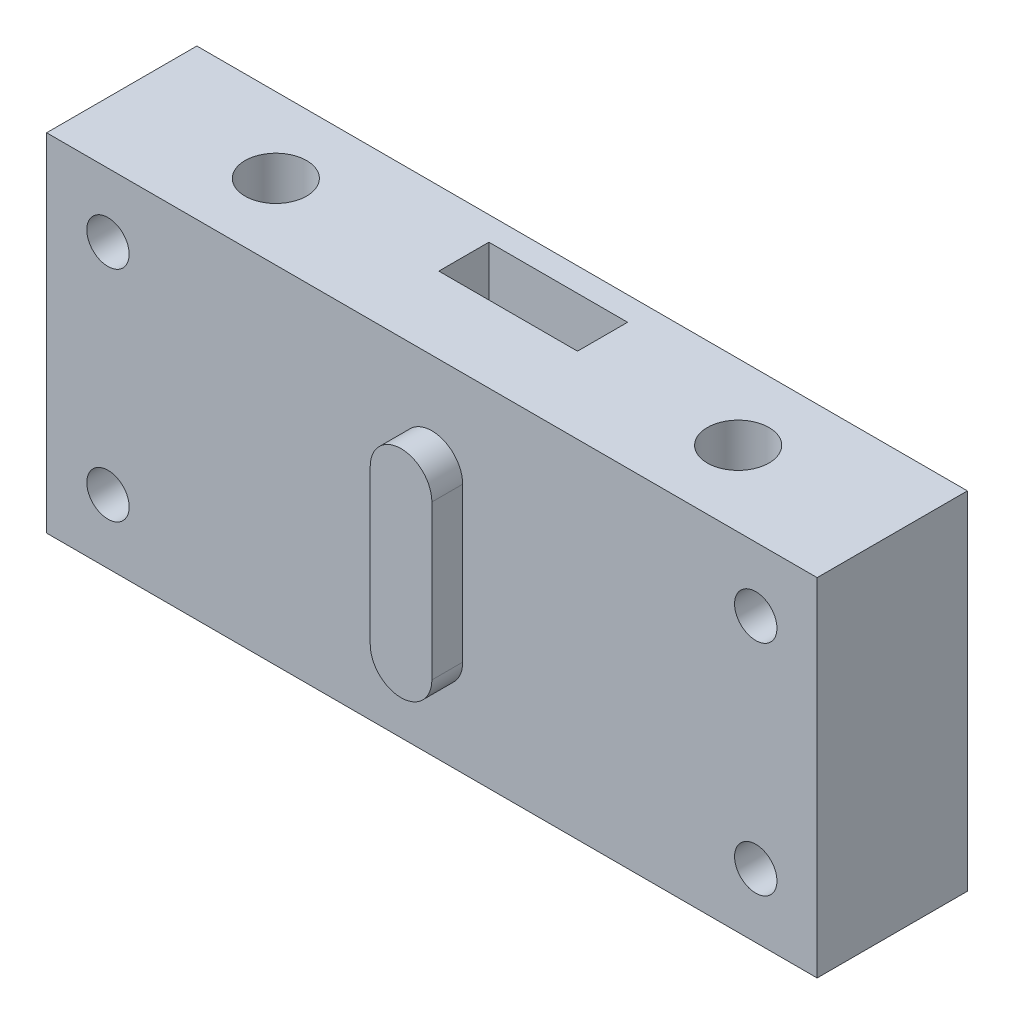
ISO-10303-21;
HEADER;
FILE_DESCRIPTION(('STEP AP214'),'2;1');
FILE_NAME('part.step','',(''),(''),'','','');
FILE_SCHEMA(('AUTOMOTIVE_DESIGN { 1 0 10303 214 1 1 1 1 }'));
ENDSEC;
DATA;
#1=APPLICATION_CONTEXT('core data for automotive mechanical design processes');
#2=APPLICATION_PROTOCOL_DEFINITION('international standard','automotive_design',2000,#1);
#3=PRODUCT_CONTEXT('',#1,'mechanical');
#4=PRODUCT('Part','Part','',(#3));
#5=PRODUCT_RELATED_PRODUCT_CATEGORY('part','',(#4));
#6=PRODUCT_DEFINITION_FORMATION('','',#4);
#7=PRODUCT_DEFINITION_CONTEXT('part definition',#1,'design');
#8=PRODUCT_DEFINITION('design','',#6,#7);
#9=PRODUCT_DEFINITION_SHAPE('','',#8);
#10=(LENGTH_UNIT() NAMED_UNIT(*) SI_UNIT(.MILLI.,.METRE.));
#11=(NAMED_UNIT(*) PLANE_ANGLE_UNIT() SI_UNIT($,.RADIAN.));
#12=(NAMED_UNIT(*) SI_UNIT($,.STERADIAN.) SOLID_ANGLE_UNIT());
#13=UNCERTAINTY_MEASURE_WITH_UNIT(LENGTH_MEASURE(1.E-05),#10,'distance_accuracy_value','');
#14=(GEOMETRIC_REPRESENTATION_CONTEXT(3) GLOBAL_UNCERTAINTY_ASSIGNED_CONTEXT((#13)) GLOBAL_UNIT_ASSIGNED_CONTEXT((#10,
#11,#12)) REPRESENTATION_CONTEXT('',''));
#15=CARTESIAN_POINT('',(0.,0.,0.));
#16=DIRECTION('',(0.,0.,1.));
#17=DIRECTION('',(1.,0.,0.));
#18=AXIS2_PLACEMENT_3D('',#15,#16,#17);
#19=CARTESIAN_POINT('',(0.,0.,19.5));
#20=DIRECTION('',(0.,0.,-1.));
#21=DIRECTION('',(-1.,0.,0.));
#22=AXIS2_PLACEMENT_3D('',#19,#20,#21);
#23=PLANE('',#22);
#24=DIRECTION('',(0.,-1.,0.));
#25=VECTOR('',#24,1.);
#26=CARTESIAN_POINT('',(-50.,22.5,19.5));
#27=LINE('',#26,#25);
#28=CARTESIAN_POINT('',(-50.,22.5,19.5));
#29=VERTEX_POINT('',#28);
#30=CARTESIAN_POINT('',(-50.,-22.5,19.5));
#31=VERTEX_POINT('',#30);
#32=EDGE_CURVE('E271',#29,#31,#27,.T.);
#33=ORIENTED_EDGE('',*,*,#32,.T.);
#34=DIRECTION('',(1.,0.,0.));
#35=VECTOR('',#34,1.);
#36=CARTESIAN_POINT('',(50.,-22.5,19.5));
#37=LINE('',#36,#35);
#38=CARTESIAN_POINT('',(50.,-22.5,19.5));
#39=VERTEX_POINT('',#38);
#40=EDGE_CURVE('E274',#31,#39,#37,.T.);
#41=ORIENTED_EDGE('',*,*,#40,.T.);
#42=DIRECTION('',(0.,1.,0.));
#43=VECTOR('',#42,1.);
#44=CARTESIAN_POINT('',(50.,22.5,19.5));
#45=LINE('',#44,#43);
#46=CARTESIAN_POINT('',(50.,22.5,19.5));
#47=VERTEX_POINT('',#46);
#48=EDGE_CURVE('E277',#39,#47,#45,.T.);
#49=ORIENTED_EDGE('',*,*,#48,.T.);
#50=DIRECTION('',(-1.,0.,0.));
#51=VECTOR('',#50,1.);
#52=CARTESIAN_POINT('',(50.,22.5,19.5));
#53=LINE('',#52,#51);
#54=EDGE_CURVE('E279',#47,#29,#53,.T.);
#55=ORIENTED_EDGE('',*,*,#54,.T.);
#56=EDGE_LOOP('',(#33,#41,#49,#55));
#57=FACE_BOUND('',#56,.T.);
#58=CARTESIAN_POINT('',(42.034787684969,14.200000000001,19.5));
#59=DIRECTION('',(0.,0.,-1.));
#60=DIRECTION('',(-1.,0.,0.));
#61=AXIS2_PLACEMENT_3D('',#58,#59,#60);
#62=CIRCLE('',#61,2.75);
#63=CARTESIAN_POINT('',(39.284787684969,14.200000000001,19.5));
#64=VERTEX_POINT('',#63);
#65=EDGE_CURVE('E253',#64,#64,#62,.T.);
#66=ORIENTED_EDGE('',*,*,#65,.T.);
#67=EDGE_LOOP('',(#66));
#68=FACE_BOUND('',#67,.T.);
#69=CARTESIAN_POINT('',(42.0347876849692,-14.2000000000005,19.5));
#70=DIRECTION('',(0.,0.,-1.));
#71=DIRECTION('',(-1.,0.,0.));
#72=AXIS2_PLACEMENT_3D('',#69,#70,#71);
#73=CIRCLE('',#72,2.7500000000004);
#74=CARTESIAN_POINT('',(39.2847876849688,-14.2000000000005,19.5));
#75=VERTEX_POINT('',#74);
#76=EDGE_CURVE('E235',#75,#75,#73,.T.);
#77=ORIENTED_EDGE('',*,*,#76,.T.);
#78=EDGE_LOOP('',(#77));
#79=FACE_BOUND('',#78,.T.);
#80=CARTESIAN_POINT('',(-42.0347876849692,-14.2000000000005,19.5));
#81=DIRECTION('',(0.,0.,-1.));
#82=DIRECTION('',(1.,0.,0.));
#83=AXIS2_PLACEMENT_3D('',#80,#81,#82);
#84=CIRCLE('',#83,2.75000000000038);
#85=CARTESIAN_POINT('',(-39.2847876849688,-14.2000000000005,19.5));
#86=VERTEX_POINT('',#85);
#87=EDGE_CURVE('E242',#86,#86,#84,.T.);
#88=ORIENTED_EDGE('',*,*,#87,.T.);
#89=EDGE_LOOP('',(#88));
#90=FACE_BOUND('',#89,.T.);
#91=CARTESIAN_POINT('',(-42.034787684969,14.200000000001,19.5));
#92=DIRECTION('',(0.,0.,-1.));
#93=DIRECTION('',(1.,0.,0.));
#94=AXIS2_PLACEMENT_3D('',#91,#92,#93);
#95=CIRCLE('',#94,2.75);
#96=CARTESIAN_POINT('',(-39.284787684969,14.200000000001,19.5));
#97=VERTEX_POINT('',#96);
#98=EDGE_CURVE('E248',#97,#97,#95,.T.);
#99=ORIENTED_EDGE('',*,*,#98,.T.);
#100=EDGE_LOOP('',(#99));
#101=FACE_BOUND('',#100,.T.);
#102=CARTESIAN_POINT('',(0.,10.,19.5));
#103=DIRECTION('',(0.,0.,1.));
#104=DIRECTION('',(1.,0.,0.));
#105=AXIS2_PLACEMENT_3D('',#102,#103,#104);
#106=CIRCLE('',#105,4.);
#107=CARTESIAN_POINT('',(4.,10.,19.5));
#108=VERTEX_POINT('',#107);
#109=CARTESIAN_POINT('',(-4.,10.,19.5));
#110=VERTEX_POINT('',#109);
#111=EDGE_CURVE('E166',#108,#110,#106,.T.);
#112=ORIENTED_EDGE('',*,*,#111,.F.);
#113=DIRECTION('',(0.,1.,0.));
#114=VECTOR('',#113,1.);
#115=CARTESIAN_POINT('',(4.,10.,19.5));
#116=LINE('',#115,#114);
#117=CARTESIAN_POINT('',(4.,-10.,19.5));
#118=VERTEX_POINT('',#117);
#119=EDGE_CURVE('E163',#118,#108,#116,.T.);
#120=ORIENTED_EDGE('',*,*,#119,.F.);
#121=CARTESIAN_POINT('',(0.,-10.,19.5));
#122=DIRECTION('',(0.,0.,1.));
#123=DIRECTION('',(1.,0.,0.));
#124=AXIS2_PLACEMENT_3D('',#121,#122,#123);
#125=CIRCLE('',#124,4.);
#126=CARTESIAN_POINT('',(-4.,-10.,19.5));
#127=VERTEX_POINT('',#126);
#128=EDGE_CURVE('E53',#127,#118,#125,.T.);
#129=ORIENTED_EDGE('',*,*,#128,.F.);
#130=DIRECTION('',(0.,-1.,0.));
#131=VECTOR('',#130,1.);
#132=CARTESIAN_POINT('',(-4.,10.,19.5));
#133=LINE('',#132,#131);
#134=EDGE_CURVE('E48',#110,#127,#133,.T.);
#135=ORIENTED_EDGE('',*,*,#134,.F.);
#136=EDGE_LOOP('',(#112,#120,#129,#135));
#137=FACE_BOUND('',#136,.T.);
#138=ADVANCED_FACE('F33',(#57,#68,#79,#90,#101,#137),#23,.F.);
#139=CARTESIAN_POINT('',(-8.99999999999998,-22.5,3.10000000000001));
#140=DIRECTION('',(0.,0.,-1.));
#141=DIRECTION('',(-1.,0.,0.));
#142=AXIS2_PLACEMENT_3D('',#139,#140,#141);
#143=PLANE('',#142);
#144=DIRECTION('',(0.,1.,0.));
#145=VECTOR('',#144,1.);
#146=CARTESIAN_POINT('',(8.99999999999999,-22.5,3.1));
#147=LINE('',#146,#145);
#148=CARTESIAN_POINT('',(8.99999999999999,-22.5,3.1));
#149=VERTEX_POINT('',#148);
#150=CARTESIAN_POINT('',(8.99999999999998,-5.,3.1));
#151=VERTEX_POINT('',#150);
#152=EDGE_CURVE('E227',#149,#151,#147,.T.);
#153=ORIENTED_EDGE('',*,*,#152,.T.);
#154=DIRECTION('',(-1.,0.,0.));
#155=VECTOR('',#154,1.);
#156=CARTESIAN_POINT('',(-8.99999999999998,-5.,3.10000000000001));
#157=LINE('',#156,#155);
#158=CARTESIAN_POINT('',(-8.99999999999998,-5.,3.10000000000001));
#159=VERTEX_POINT('',#158);
#160=EDGE_CURVE('E195',#151,#159,#157,.T.);
#161=ORIENTED_EDGE('',*,*,#160,.T.);
#162=DIRECTION('',(0.,1.,0.));
#163=VECTOR('',#162,1.);
#164=CARTESIAN_POINT('',(-8.99999999999998,-22.5,3.10000000000001));
#165=LINE('',#164,#163);
#166=CARTESIAN_POINT('',(-8.99999999999998,-22.5,3.10000000000001));
#167=VERTEX_POINT('',#166);
#168=EDGE_CURVE('E222',#167,#159,#165,.T.);
#169=ORIENTED_EDGE('',*,*,#168,.F.);
#170=DIRECTION('',(-1.,0.,0.));
#171=VECTOR('',#170,1.);
#172=CARTESIAN_POINT('',(-8.99999999999998,-22.5,3.10000000000001));
#173=LINE('',#172,#171);
#174=EDGE_CURVE('E209',#149,#167,#173,.T.);
#175=ORIENTED_EDGE('',*,*,#174,.F.);
#176=EDGE_LOOP('',(#153,#161,#169,#175));
#177=FACE_BOUND('',#176,.T.);
#178=ADVANCED_FACE('F322',(#177),#143,.F.);
#179=CARTESIAN_POINT('',(-50.,22.5,19.5));
#180=DIRECTION('',(1.,0.,0.));
#181=DIRECTION('',(0.,1.,0.));
#182=AXIS2_PLACEMENT_3D('',#179,#180,#181);
#183=PLANE('',#182);
#184=DIRECTION('',(0.,-1.,0.));
#185=VECTOR('',#184,1.);
#186=CARTESIAN_POINT('',(-50.,22.5,0.));
#187=LINE('',#186,#185);
#188=CARTESIAN_POINT('',(-50.,22.5,0.));
#189=VERTEX_POINT('',#188);
#190=CARTESIAN_POINT('',(-50.,-22.5,0.));
#191=VERTEX_POINT('',#190);
#192=EDGE_CURVE('E262',#189,#191,#187,.T.);
#193=ORIENTED_EDGE('',*,*,#192,.T.);
#194=DIRECTION('',(0.,0.,-1.));
#195=VECTOR('',#194,1.);
#196=CARTESIAN_POINT('',(-50.,-22.5,19.5));
#197=LINE('',#196,#195);
#198=EDGE_CURVE('E11',#31,#191,#197,.T.);
#199=ORIENTED_EDGE('',*,*,#198,.F.);
#200=ORIENTED_EDGE('',*,*,#32,.F.);
#201=DIRECTION('',(0.,0.,-1.));
#202=VECTOR('',#201,1.);
#203=CARTESIAN_POINT('',(-50.,22.5,19.5));
#204=LINE('',#203,#202);
#205=EDGE_CURVE('E281',#29,#189,#204,.T.);
#206=ORIENTED_EDGE('',*,*,#205,.T.);
#207=EDGE_LOOP('',(#193,#199,#200,#206));
#208=FACE_BOUND('',#207,.T.);
#209=ADVANCED_FACE('F35',(#208),#183,.F.);
#210=CARTESIAN_POINT('',(50.,-22.5,19.5));
#211=DIRECTION('',(0.,1.,0.));
#212=DIRECTION('',(-1.,0.,0.));
#213=AXIS2_PLACEMENT_3D('',#210,#211,#212);
#214=PLANE('',#213);
#215=ORIENTED_EDGE('',*,*,#174,.T.);
#216=DIRECTION('',(0.,0.,1.));
#217=VECTOR('',#216,1.);
#218=CARTESIAN_POINT('',(-8.99999999999998,-22.5,9.60000000000001));
#219=LINE('',#218,#217);
#220=CARTESIAN_POINT('',(-8.99999999999998,-22.5,9.60000000000001));
#221=VERTEX_POINT('',#220);
#222=EDGE_CURVE('E199',#167,#221,#219,.T.);
#223=ORIENTED_EDGE('',*,*,#222,.T.);
#224=DIRECTION('',(1.,0.,0.));
#225=VECTOR('',#224,1.);
#226=CARTESIAN_POINT('',(-8.99999999999998,-22.5,9.60000000000001));
#227=LINE('',#226,#225);
#228=CARTESIAN_POINT('',(8.99999999999999,-22.5,9.60000000000001));
#229=VERTEX_POINT('',#228);
#230=EDGE_CURVE('E202',#221,#229,#227,.T.);
#231=ORIENTED_EDGE('',*,*,#230,.T.);
#232=DIRECTION('',(0.,0.,-1.));
#233=VECTOR('',#232,1.);
#234=CARTESIAN_POINT('',(8.99999999999999,-22.5,9.60000000000001));
#235=LINE('',#234,#233);
#236=EDGE_CURVE('E206',#229,#149,#235,.T.);
#237=ORIENTED_EDGE('',*,*,#236,.T.);
#238=EDGE_LOOP('',(#215,#223,#231,#237));
#239=FACE_BOUND('',#238,.T.);
#240=CARTESIAN_POINT('',(-30.,-22.5,9.75000000000001));
#241=DIRECTION('',(0.,1.,0.));
#242=DIRECTION('',(-1.,0.,0.));
#243=AXIS2_PLACEMENT_3D('',#240,#241,#242);
#244=CIRCLE('',#243,4.);
#245=CARTESIAN_POINT('',(-34.,-22.5,9.75000000000001));
#246=VERTEX_POINT('',#245);
#247=EDGE_CURVE('E259',#246,#246,#244,.T.);
#248=ORIENTED_EDGE('',*,*,#247,.T.);
#249=EDGE_LOOP('',(#248));
#250=FACE_BOUND('',#249,.T.);
#251=CARTESIAN_POINT('',(30.,-22.5,9.75));
#252=DIRECTION('',(0.,1.,0.));
#253=DIRECTION('',(-1.,0.,0.));
#254=AXIS2_PLACEMENT_3D('',#251,#252,#253);
#255=CIRCLE('',#254,4.00000000000001);
#256=CARTESIAN_POINT('',(26.,-22.5,9.75));
#257=VERTEX_POINT('',#256);
#258=EDGE_CURVE('E266',#257,#257,#255,.T.);
#259=ORIENTED_EDGE('',*,*,#258,.T.);
#260=EDGE_LOOP('',(#259));
#261=FACE_BOUND('',#260,.T.);
#262=DIRECTION('',(1.,0.,0.));
#263=VECTOR('',#262,1.);
#264=CARTESIAN_POINT('',(50.,-22.5,0.));
#265=LINE('',#264,#263);
#266=CARTESIAN_POINT('',(50.,-22.5,0.));
#267=VERTEX_POINT('',#266);
#268=EDGE_CURVE('E284',#191,#267,#265,.T.);
#269=ORIENTED_EDGE('',*,*,#268,.T.);
#270=DIRECTION('',(0.,0.,-1.));
#271=VECTOR('',#270,1.);
#272=CARTESIAN_POINT('',(50.,-22.5,19.5));
#273=LINE('',#272,#271);
#274=EDGE_CURVE('E41',#39,#267,#273,.T.);
#275=ORIENTED_EDGE('',*,*,#274,.F.);
#276=ORIENTED_EDGE('',*,*,#40,.F.);
#277=ORIENTED_EDGE('',*,*,#198,.T.);
#278=EDGE_LOOP('',(#269,#275,#276,#277));
#279=FACE_BOUND('',#278,.T.);
#280=ADVANCED_FACE('F314',(#239,#250,#261,#279),#214,.F.);
#281=CARTESIAN_POINT('',(50.,22.5,19.5));
#282=DIRECTION('',(-1.,0.,0.));
#283=DIRECTION('',(0.,0.,1.));
#284=AXIS2_PLACEMENT_3D('',#281,#282,#283);
#285=PLANE('',#284);
#286=DIRECTION('',(0.,1.,0.));
#287=VECTOR('',#286,1.);
#288=CARTESIAN_POINT('',(50.,22.5,0.));
#289=LINE('',#288,#287);
#290=CARTESIAN_POINT('',(50.,22.5,0.));
#291=VERTEX_POINT('',#290);
#292=EDGE_CURVE('E286',#267,#291,#289,.T.);
#293=ORIENTED_EDGE('',*,*,#292,.T.);
#294=DIRECTION('',(0.,0.,-1.));
#295=VECTOR('',#294,1.);
#296=CARTESIAN_POINT('',(50.,22.5,19.5));
#297=LINE('',#296,#295);
#298=EDGE_CURVE('E291',#47,#291,#297,.T.);
#299=ORIENTED_EDGE('',*,*,#298,.F.);
#300=ORIENTED_EDGE('',*,*,#48,.F.);
#301=ORIENTED_EDGE('',*,*,#274,.T.);
#302=EDGE_LOOP('',(#293,#299,#300,#301));
#303=FACE_BOUND('',#302,.T.);
#304=ADVANCED_FACE('F298',(#303),#285,.F.);
#305=CARTESIAN_POINT('',(50.,22.5,19.5));
#306=DIRECTION('',(0.,-1.,0.));
#307=DIRECTION('',(1.,0.,0.));
#308=AXIS2_PLACEMENT_3D('',#305,#306,#307);
#309=PLANE('',#308);
#310=DIRECTION('',(1.,0.,0.));
#311=VECTOR('',#310,1.);
#312=CARTESIAN_POINT('',(-8.99999999999999,22.5,9.60000000000001));
#313=LINE('',#312,#311);
#314=CARTESIAN_POINT('',(-8.99999999999999,22.5,9.60000000000001));
#315=VERTEX_POINT('',#314);
#316=CARTESIAN_POINT('',(8.99999999999999,22.5,9.60000000000001));
#317=VERTEX_POINT('',#316);
#318=EDGE_CURVE('E214',#315,#317,#313,.T.);
#319=ORIENTED_EDGE('',*,*,#318,.F.);
#320=DIRECTION('',(0.,0.,1.));
#321=VECTOR('',#320,1.);
#322=CARTESIAN_POINT('',(-8.99999999999999,22.5,9.60000000000001));
#323=LINE('',#322,#321);
#324=CARTESIAN_POINT('',(-8.99999999999999,22.5,3.10000000000001));
#325=VERTEX_POINT('',#324);
#326=EDGE_CURVE('E198',#325,#315,#323,.T.);
#327=ORIENTED_EDGE('',*,*,#326,.F.);
#328=DIRECTION('',(-1.,0.,0.));
#329=VECTOR('',#328,1.);
#330=CARTESIAN_POINT('',(-8.99999999999999,22.5,3.10000000000001));
#331=LINE('',#330,#329);
#332=CARTESIAN_POINT('',(8.99999999999998,22.5,3.1));
#333=VERTEX_POINT('',#332);
#334=EDGE_CURVE('E203',#333,#325,#331,.T.);
#335=ORIENTED_EDGE('',*,*,#334,.F.);
#336=DIRECTION('',(0.,0.,-1.));
#337=VECTOR('',#336,1.);
#338=CARTESIAN_POINT('',(8.99999999999999,22.5,9.60000000000001));
#339=LINE('',#338,#337);
#340=EDGE_CURVE('E217',#317,#333,#339,.T.);
#341=ORIENTED_EDGE('',*,*,#340,.F.);
#342=EDGE_LOOP('',(#319,#327,#335,#341));
#343=FACE_BOUND('',#342,.T.);
#344=CARTESIAN_POINT('',(-30.,22.5,9.75000000000001));
#345=DIRECTION('',(0.,1.,0.));
#346=DIRECTION('',(-1.,0.,0.));
#347=AXIS2_PLACEMENT_3D('',#344,#345,#346);
#348=CIRCLE('',#347,4.);
#349=CARTESIAN_POINT('',(-34.,22.5,9.75000000000001));
#350=VERTEX_POINT('',#349);
#351=EDGE_CURVE('E263',#350,#350,#348,.T.);
#352=ORIENTED_EDGE('',*,*,#351,.F.);
#353=EDGE_LOOP('',(#352));
#354=FACE_BOUND('',#353,.T.);
#355=CARTESIAN_POINT('',(30.,22.5,9.75));
#356=DIRECTION('',(0.,1.,0.));
#357=DIRECTION('',(-1.,0.,0.));
#358=AXIS2_PLACEMENT_3D('',#355,#356,#357);
#359=CIRCLE('',#358,4.00000000000001);
#360=CARTESIAN_POINT('',(26.,22.5,9.75));
#361=VERTEX_POINT('',#360);
#362=EDGE_CURVE('E256',#361,#361,#359,.T.);
#363=ORIENTED_EDGE('',*,*,#362,.F.);
#364=EDGE_LOOP('',(#363));
#365=FACE_BOUND('',#364,.T.);
#366=DIRECTION('',(-1.,0.,0.));
#367=VECTOR('',#366,1.);
#368=CARTESIAN_POINT('',(50.,22.5,0.));
#369=LINE('',#368,#367);
#370=EDGE_CURVE('E275',#291,#189,#369,.T.);
#371=ORIENTED_EDGE('',*,*,#370,.T.);
#372=ORIENTED_EDGE('',*,*,#205,.F.);
#373=ORIENTED_EDGE('',*,*,#54,.F.);
#374=ORIENTED_EDGE('',*,*,#298,.T.);
#375=EDGE_LOOP('',(#371,#372,#373,#374));
#376=FACE_BOUND('',#375,.T.);
#377=ADVANCED_FACE('F307',(#343,#354,#365,#376),#309,.F.);
#378=CARTESIAN_POINT('',(0.,0.,0.));
#379=DIRECTION('',(0.,0.,-1.));
#380=DIRECTION('',(-1.,0.,0.));
#381=AXIS2_PLACEMENT_3D('',#378,#379,#380);
#382=PLANE('',#381);
#383=DIRECTION('',(0.,1.,0.));
#384=VECTOR('',#383,1.);
#385=CARTESIAN_POINT('',(-8.99999999999998,5.,0.));
#386=LINE('',#385,#384);
#387=CARTESIAN_POINT('',(-8.99999999999998,-5.,0.));
#388=VERTEX_POINT('',#387);
#389=CARTESIAN_POINT('',(-8.99999999999998,5.,0.));
#390=VERTEX_POINT('',#389);
#391=EDGE_CURVE('E167',#388,#390,#386,.T.);
#392=ORIENTED_EDGE('',*,*,#391,.F.);
#393=DIRECTION('',(-1.,0.,0.));
#394=VECTOR('',#393,1.);
#395=CARTESIAN_POINT('',(8.99999999999998,-5.,0.));
#396=LINE('',#395,#394);
#397=CARTESIAN_POINT('',(8.99999999999998,-5.,0.));
#398=VERTEX_POINT('',#397);
#399=EDGE_CURVE('E180',#398,#388,#396,.T.);
#400=ORIENTED_EDGE('',*,*,#399,.F.);
#401=DIRECTION('',(0.,-1.,0.));
#402=VECTOR('',#401,1.);
#403=CARTESIAN_POINT('',(8.99999999999998,5.,0.));
#404=LINE('',#403,#402);
#405=CARTESIAN_POINT('',(8.99999999999998,5.,0.));
#406=VERTEX_POINT('',#405);
#407=EDGE_CURVE('E177',#406,#398,#404,.T.);
#408=ORIENTED_EDGE('',*,*,#407,.F.);
#409=DIRECTION('',(1.,0.,0.));
#410=VECTOR('',#409,1.);
#411=CARTESIAN_POINT('',(8.99999999999998,5.,0.));
#412=LINE('',#411,#410);
#413=EDGE_CURVE('E169',#390,#406,#412,.T.);
#414=ORIENTED_EDGE('',*,*,#413,.F.);
#415=EDGE_LOOP('',(#392,#400,#408,#414));
#416=FACE_BOUND('',#415,.T.);
#417=CARTESIAN_POINT('',(-42.034787684969,14.200000000001,0.));
#418=DIRECTION('',(0.,0.,-1.));
#419=DIRECTION('',(1.,0.,0.));
#420=AXIS2_PLACEMENT_3D('',#417,#418,#419);
#421=CIRCLE('',#420,2.75);
#422=CARTESIAN_POINT('',(-39.284787684969,14.200000000001,0.));
#423=VERTEX_POINT('',#422);
#424=EDGE_CURVE('E225',#423,#423,#421,.T.);
#425=ORIENTED_EDGE('',*,*,#424,.F.);
#426=EDGE_LOOP('',(#425));
#427=FACE_BOUND('',#426,.T.);
#428=CARTESIAN_POINT('',(-42.0347876849692,-14.2000000000005,0.));
#429=DIRECTION('',(0.,0.,-1.));
#430=DIRECTION('',(1.,0.,0.));
#431=AXIS2_PLACEMENT_3D('',#428,#429,#430);
#432=CIRCLE('',#431,2.75000000000038);
#433=CARTESIAN_POINT('',(-39.2847876849688,-14.2000000000005,0.));
#434=VERTEX_POINT('',#433);
#435=EDGE_CURVE('E245',#434,#434,#432,.T.);
#436=ORIENTED_EDGE('',*,*,#435,.F.);
#437=EDGE_LOOP('',(#436));
#438=FACE_BOUND('',#437,.T.);
#439=CARTESIAN_POINT('',(42.0347876849692,-14.2000000000005,0.));
#440=DIRECTION('',(0.,0.,-1.));
#441=DIRECTION('',(-1.,0.,0.));
#442=AXIS2_PLACEMENT_3D('',#439,#440,#441);
#443=CIRCLE('',#442,2.7500000000004);
#444=CARTESIAN_POINT('',(39.2847876849688,-14.2000000000005,0.));
#445=VERTEX_POINT('',#444);
#446=EDGE_CURVE('E239',#445,#445,#443,.T.);
#447=ORIENTED_EDGE('',*,*,#446,.F.);
#448=EDGE_LOOP('',(#447));
#449=FACE_BOUND('',#448,.T.);
#450=CARTESIAN_POINT('',(42.034787684969,14.200000000001,0.));
#451=DIRECTION('',(0.,0.,-1.));
#452=DIRECTION('',(-1.,0.,0.));
#453=AXIS2_PLACEMENT_3D('',#450,#451,#452);
#454=CIRCLE('',#453,2.75);
#455=CARTESIAN_POINT('',(39.284787684969,14.200000000001,0.));
#456=VERTEX_POINT('',#455);
#457=EDGE_CURVE('E238',#456,#456,#454,.T.);
#458=ORIENTED_EDGE('',*,*,#457,.F.);
#459=EDGE_LOOP('',(#458));
#460=FACE_BOUND('',#459,.T.);
#461=ORIENTED_EDGE('',*,*,#192,.F.);
#462=ORIENTED_EDGE('',*,*,#370,.F.);
#463=ORIENTED_EDGE('',*,*,#292,.F.);
#464=ORIENTED_EDGE('',*,*,#268,.F.);
#465=EDGE_LOOP('',(#461,#462,#463,#464));
#466=FACE_BOUND('',#465,.T.);
#467=ADVANCED_FACE('F304',(#416,#427,#438,#449,#460,#466),#382,.T.);
#468=CARTESIAN_POINT('',(30.,-22.5,9.75));
#469=DIRECTION('',(0.,1.,0.));
#470=DIRECTION('',(-1.,0.,0.));
#471=AXIS2_PLACEMENT_3D('',#468,#469,#470);
#472=CYLINDRICAL_SURFACE('',#471,4.00000000000001);
#473=ORIENTED_EDGE('',*,*,#258,.F.);
#474=EDGE_LOOP('',(#473));
#475=FACE_BOUND('',#474,.T.);
#476=ORIENTED_EDGE('',*,*,#362,.T.);
#477=EDGE_LOOP('',(#476));
#478=FACE_BOUND('',#477,.T.);
#479=ADVANCED_FACE('F334',(#475,#478),#472,.F.);
#480=CARTESIAN_POINT('',(-30.,-22.5,9.75000000000001));
#481=DIRECTION('',(0.,1.,0.));
#482=DIRECTION('',(-1.,0.,0.));
#483=AXIS2_PLACEMENT_3D('',#480,#481,#482);
#484=CYLINDRICAL_SURFACE('',#483,4.);
#485=ORIENTED_EDGE('',*,*,#247,.F.);
#486=EDGE_LOOP('',(#485));
#487=FACE_BOUND('',#486,.T.);
#488=ORIENTED_EDGE('',*,*,#351,.T.);
#489=EDGE_LOOP('',(#488));
#490=FACE_BOUND('',#489,.T.);
#491=ADVANCED_FACE('F352',(#487,#490),#484,.F.);
#492=CARTESIAN_POINT('',(42.034787684969,14.200000000001,19.5));
#493=DIRECTION('',(0.,0.,-1.));
#494=DIRECTION('',(-1.,0.,0.));
#495=AXIS2_PLACEMENT_3D('',#492,#493,#494);
#496=CYLINDRICAL_SURFACE('',#495,2.75);
#497=ORIENTED_EDGE('',*,*,#65,.F.);
#498=EDGE_LOOP('',(#497));
#499=FACE_BOUND('',#498,.T.);
#500=ORIENTED_EDGE('',*,*,#457,.T.);
#501=EDGE_LOOP('',(#500));
#502=FACE_BOUND('',#501,.T.);
#503=ADVANCED_FACE('F357',(#499,#502),#496,.F.);
#504=CARTESIAN_POINT('',(42.0347876849692,-14.2000000000005,19.5));
#505=DIRECTION('',(0.,0.,-1.));
#506=DIRECTION('',(-1.,0.,0.));
#507=AXIS2_PLACEMENT_3D('',#504,#505,#506);
#508=CYLINDRICAL_SURFACE('',#507,2.7500000000004);
#509=ORIENTED_EDGE('',*,*,#76,.F.);
#510=EDGE_LOOP('',(#509));
#511=FACE_BOUND('',#510,.T.);
#512=ORIENTED_EDGE('',*,*,#446,.T.);
#513=EDGE_LOOP('',(#512));
#514=FACE_BOUND('',#513,.T.);
#515=ADVANCED_FACE('F364',(#511,#514),#508,.F.);
#516=CARTESIAN_POINT('',(-42.0347876849692,-14.2000000000005,19.5));
#517=DIRECTION('',(0.,0.,-1.));
#518=DIRECTION('',(-1.,0.,0.));
#519=AXIS2_PLACEMENT_3D('',#516,#517,#518);
#520=CYLINDRICAL_SURFACE('',#519,2.75000000000038);
#521=ORIENTED_EDGE('',*,*,#87,.F.);
#522=EDGE_LOOP('',(#521));
#523=FACE_BOUND('',#522,.T.);
#524=ORIENTED_EDGE('',*,*,#435,.T.);
#525=EDGE_LOOP('',(#524));
#526=FACE_BOUND('',#525,.T.);
#527=ADVANCED_FACE('F374',(#523,#526),#520,.F.);
#528=CARTESIAN_POINT('',(-42.034787684969,14.200000000001,19.5));
#529=DIRECTION('',(0.,0.,-1.));
#530=DIRECTION('',(-1.,0.,0.));
#531=AXIS2_PLACEMENT_3D('',#528,#529,#530);
#532=CYLINDRICAL_SURFACE('',#531,2.75);
#533=ORIENTED_EDGE('',*,*,#98,.F.);
#534=EDGE_LOOP('',(#533));
#535=FACE_BOUND('',#534,.T.);
#536=ORIENTED_EDGE('',*,*,#424,.T.);
#537=EDGE_LOOP('',(#536));
#538=FACE_BOUND('',#537,.T.);
#539=ADVANCED_FACE('F370',(#535,#538),#532,.F.);
#540=CARTESIAN_POINT('',(-8.99999999999998,-22.5,9.60000000000001));
#541=DIRECTION('',(-1.,0.,0.));
#542=DIRECTION('',(0.,-1.,0.));
#543=AXIS2_PLACEMENT_3D('',#540,#541,#542);
#544=PLANE('',#543);
#545=DIRECTION('',(0.,0.,-1.));
#546=VECTOR('',#545,1.);
#547=CARTESIAN_POINT('',(-8.99999999999998,5.,4.));
#548=LINE('',#547,#546);
#549=CARTESIAN_POINT('',(-8.99999999999998,5.,3.10000000000001));
#550=VERTEX_POINT('',#549);
#551=EDGE_CURVE('E183',#550,#390,#548,.T.);
#552=ORIENTED_EDGE('',*,*,#551,.F.);
#553=EDGE_CURVE('E226',#550,#325,#165,.T.);
#554=ORIENTED_EDGE('',*,*,#553,.T.);
#555=ORIENTED_EDGE('',*,*,#326,.T.);
#556=DIRECTION('',(0.,1.,0.));
#557=VECTOR('',#556,1.);
#558=CARTESIAN_POINT('',(-8.99999999999998,-22.5,9.60000000000001));
#559=LINE('',#558,#557);
#560=EDGE_CURVE('E212',#221,#315,#559,.T.);
#561=ORIENTED_EDGE('',*,*,#560,.F.);
#562=ORIENTED_EDGE('',*,*,#222,.F.);
#563=ORIENTED_EDGE('',*,*,#168,.T.);
#564=DIRECTION('',(0.,0.,-1.));
#565=VECTOR('',#564,1.);
#566=CARTESIAN_POINT('',(-8.99999999999998,-5.,4.));
#567=LINE('',#566,#565);
#568=EDGE_CURVE('E184',#159,#388,#567,.T.);
#569=ORIENTED_EDGE('',*,*,#568,.T.);
#570=ORIENTED_EDGE('',*,*,#391,.T.);
#571=EDGE_LOOP('',(#552,#554,#555,#561,#562,#563,#569,#570));
#572=FACE_BOUND('',#571,.T.);
#573=ADVANCED_FACE('F373',(#572),#544,.F.);
#574=ORIENTED_EDGE('',*,*,#553,.F.);
#575=DIRECTION('',(1.,0.,0.));
#576=VECTOR('',#575,1.);
#577=CARTESIAN_POINT('',(-8.99999999999998,5.,3.10000000000001));
#578=LINE('',#577,#576);
#579=CARTESIAN_POINT('',(8.99999999999999,5.,3.1));
#580=VERTEX_POINT('',#579);
#581=EDGE_CURVE('E186',#550,#580,#578,.T.);
#582=ORIENTED_EDGE('',*,*,#581,.T.);
#583=EDGE_CURVE('E230',#580,#333,#147,.T.);
#584=ORIENTED_EDGE('',*,*,#583,.T.);
#585=ORIENTED_EDGE('',*,*,#334,.T.);
#586=EDGE_LOOP('',(#574,#582,#584,#585));
#587=FACE_BOUND('',#586,.T.);
#588=ADVANCED_FACE('F331',(#587),#143,.F.);
#589=CARTESIAN_POINT('',(8.99999999999999,-22.5,9.60000000000001));
#590=DIRECTION('',(1.,0.,0.));
#591=DIRECTION('',(0.,0.,-1.));
#592=AXIS2_PLACEMENT_3D('',#589,#590,#591);
#593=PLANE('',#592);
#594=ORIENTED_EDGE('',*,*,#583,.F.);
#595=DIRECTION('',(0.,0.,-1.));
#596=VECTOR('',#595,1.);
#597=CARTESIAN_POINT('',(8.99999999999998,5.,4.));
#598=LINE('',#597,#596);
#599=EDGE_CURVE('E189',#580,#406,#598,.T.);
#600=ORIENTED_EDGE('',*,*,#599,.T.);
#601=ORIENTED_EDGE('',*,*,#407,.T.);
#602=DIRECTION('',(0.,0.,-1.));
#603=VECTOR('',#602,1.);
#604=CARTESIAN_POINT('',(8.99999999999998,-5.,4.));
#605=LINE('',#604,#603);
#606=EDGE_CURVE('E187',#151,#398,#605,.T.);
#607=ORIENTED_EDGE('',*,*,#606,.F.);
#608=ORIENTED_EDGE('',*,*,#152,.F.);
#609=ORIENTED_EDGE('',*,*,#236,.F.);
#610=DIRECTION('',(0.,1.,0.));
#611=VECTOR('',#610,1.);
#612=CARTESIAN_POINT('',(8.99999999999999,-22.5,9.60000000000001));
#613=LINE('',#612,#611);
#614=EDGE_CURVE('E231',#229,#317,#613,.T.);
#615=ORIENTED_EDGE('',*,*,#614,.T.);
#616=ORIENTED_EDGE('',*,*,#340,.T.);
#617=EDGE_LOOP('',(#594,#600,#601,#607,#608,#609,#615,#616));
#618=FACE_BOUND('',#617,.T.);
#619=ADVANCED_FACE('F389',(#618),#593,.F.);
#620=CARTESIAN_POINT('',(-8.99999999999998,-22.5,9.60000000000001));
#621=DIRECTION('',(0.,0.,1.));
#622=DIRECTION('',(1.,0.,0.));
#623=AXIS2_PLACEMENT_3D('',#620,#621,#622);
#624=PLANE('',#623);
#625=ORIENTED_EDGE('',*,*,#318,.T.);
#626=ORIENTED_EDGE('',*,*,#614,.F.);
#627=ORIENTED_EDGE('',*,*,#230,.F.);
#628=ORIENTED_EDGE('',*,*,#560,.T.);
#629=EDGE_LOOP('',(#625,#626,#627,#628));
#630=FACE_BOUND('',#629,.T.);
#631=ADVANCED_FACE('F385',(#630),#624,.F.);
#632=CARTESIAN_POINT('',(8.99999999999998,-5.,4.));
#633=DIRECTION('',(0.,-1.,0.));
#634=DIRECTION('',(0.,0.,-1.));
#635=AXIS2_PLACEMENT_3D('',#632,#633,#634);
#636=PLANE('',#635);
#637=ORIENTED_EDGE('',*,*,#606,.T.);
#638=ORIENTED_EDGE('',*,*,#399,.T.);
#639=ORIENTED_EDGE('',*,*,#568,.F.);
#640=ORIENTED_EDGE('',*,*,#160,.F.);
#641=EDGE_LOOP('',(#637,#638,#639,#640));
#642=FACE_BOUND('',#641,.T.);
#643=ADVANCED_FACE('F388',(#642),#636,.F.);
#644=CARTESIAN_POINT('',(8.99999999999998,5.,4.));
#645=DIRECTION('',(0.,1.,0.));
#646=DIRECTION('',(0.,0.,1.));
#647=AXIS2_PLACEMENT_3D('',#644,#645,#646);
#648=PLANE('',#647);
#649=ORIENTED_EDGE('',*,*,#551,.T.);
#650=ORIENTED_EDGE('',*,*,#413,.T.);
#651=ORIENTED_EDGE('',*,*,#599,.F.);
#652=ORIENTED_EDGE('',*,*,#581,.F.);
#653=EDGE_LOOP('',(#649,#650,#651,#652));
#654=FACE_BOUND('',#653,.T.);
#655=ADVANCED_FACE('F396',(#654),#648,.F.);
#656=CARTESIAN_POINT('',(0.,10.,23.5));
#657=DIRECTION('',(0.,0.,-1.));
#658=DIRECTION('',(-1.,0.,0.));
#659=AXIS2_PLACEMENT_3D('',#656,#657,#658);
#660=CYLINDRICAL_SURFACE('',#659,4.);
#661=ORIENTED_EDGE('',*,*,#111,.T.);
#662=DIRECTION('',(0.,0.,-1.));
#663=VECTOR('',#662,1.);
#664=CARTESIAN_POINT('',(-4.,10.,23.5));
#665=LINE('',#664,#663);
#666=CARTESIAN_POINT('',(-4.,10.,23.5));
#667=VERTEX_POINT('',#666);
#668=EDGE_CURVE('E147',#667,#110,#665,.T.);
#669=ORIENTED_EDGE('',*,*,#668,.F.);
#670=CARTESIAN_POINT('',(0.,10.,23.5));
#671=DIRECTION('',(0.,0.,1.));
#672=DIRECTION('',(1.,0.,0.));
#673=AXIS2_PLACEMENT_3D('',#670,#671,#672);
#674=CIRCLE('',#673,4.);
#675=CARTESIAN_POINT('',(4.,10.,23.5));
#676=VERTEX_POINT('',#675);
#677=EDGE_CURVE('E154',#676,#667,#674,.T.);
#678=ORIENTED_EDGE('',*,*,#677,.F.);
#679=DIRECTION('',(0.,0.,-1.));
#680=VECTOR('',#679,1.);
#681=CARTESIAN_POINT('',(4.,10.,23.5));
#682=LINE('',#681,#680);
#683=EDGE_CURVE('E558',#676,#108,#682,.T.);
#684=ORIENTED_EDGE('',*,*,#683,.T.);
#685=EDGE_LOOP('',(#661,#669,#678,#684));
#686=FACE_BOUND('',#685,.T.);
#687=ADVANCED_FACE('F165',(#686),#660,.T.);
#688=CARTESIAN_POINT('',(-4.,10.,23.5));
#689=DIRECTION('',(1.,0.,0.));
#690=DIRECTION('',(0.,0.,-1.));
#691=AXIS2_PLACEMENT_3D('',#688,#689,#690);
#692=PLANE('',#691);
#693=ORIENTED_EDGE('',*,*,#134,.T.);
#694=DIRECTION('',(0.,0.,-1.));
#695=VECTOR('',#694,1.);
#696=CARTESIAN_POINT('',(-4.,-10.,23.5));
#697=LINE('',#696,#695);
#698=CARTESIAN_POINT('',(-4.,-10.,23.5));
#699=VERTEX_POINT('',#698);
#700=EDGE_CURVE('E150',#699,#127,#697,.T.);
#701=ORIENTED_EDGE('',*,*,#700,.F.);
#702=DIRECTION('',(0.,-1.,0.));
#703=VECTOR('',#702,1.);
#704=CARTESIAN_POINT('',(-4.,10.,23.5));
#705=LINE('',#704,#703);
#706=EDGE_CURVE('E143',#667,#699,#705,.T.);
#707=ORIENTED_EDGE('',*,*,#706,.F.);
#708=ORIENTED_EDGE('',*,*,#668,.T.);
#709=EDGE_LOOP('',(#693,#701,#707,#708));
#710=FACE_BOUND('',#709,.T.);
#711=ADVANCED_FACE('F145',(#710),#692,.F.);
#712=CARTESIAN_POINT('',(0.,-10.,23.5));
#713=DIRECTION('',(0.,0.,-1.));
#714=DIRECTION('',(-1.,0.,0.));
#715=AXIS2_PLACEMENT_3D('',#712,#713,#714);
#716=CYLINDRICAL_SURFACE('',#715,4.);
#717=ORIENTED_EDGE('',*,*,#128,.T.);
#718=DIRECTION('',(0.,0.,-1.));
#719=VECTOR('',#718,1.);
#720=CARTESIAN_POINT('',(4.,-10.,23.5));
#721=LINE('',#720,#719);
#722=CARTESIAN_POINT('',(4.,-10.,23.5));
#723=VERTEX_POINT('',#722);
#724=EDGE_CURVE('E171',#723,#118,#721,.T.);
#725=ORIENTED_EDGE('',*,*,#724,.F.);
#726=CARTESIAN_POINT('',(0.,-10.,23.5));
#727=DIRECTION('',(0.,0.,1.));
#728=DIRECTION('',(1.,0.,0.));
#729=AXIS2_PLACEMENT_3D('',#726,#727,#728);
#730=CIRCLE('',#729,4.);
#731=EDGE_CURVE('E153',#699,#723,#730,.T.);
#732=ORIENTED_EDGE('',*,*,#731,.F.);
#733=ORIENTED_EDGE('',*,*,#700,.T.);
#734=EDGE_LOOP('',(#717,#725,#732,#733));
#735=FACE_BOUND('',#734,.T.);
#736=ADVANCED_FACE('F407',(#735),#716,.T.);
#737=CARTESIAN_POINT('',(4.,10.,23.5));
#738=DIRECTION('',(-1.,0.,0.));
#739=DIRECTION('',(0.,0.,1.));
#740=AXIS2_PLACEMENT_3D('',#737,#738,#739);
#741=PLANE('',#740);
#742=ORIENTED_EDGE('',*,*,#119,.T.);
#743=ORIENTED_EDGE('',*,*,#683,.F.);
#744=DIRECTION('',(0.,1.,0.));
#745=VECTOR('',#744,1.);
#746=CARTESIAN_POINT('',(4.,10.,23.5));
#747=LINE('',#746,#745);
#748=EDGE_CURVE('E159',#723,#676,#747,.T.);
#749=ORIENTED_EDGE('',*,*,#748,.F.);
#750=ORIENTED_EDGE('',*,*,#724,.T.);
#751=EDGE_LOOP('',(#742,#743,#749,#750));
#752=FACE_BOUND('',#751,.T.);
#753=ADVANCED_FACE('F410',(#752),#741,.F.);
#754=CARTESIAN_POINT('',(0.,10.,23.5));
#755=DIRECTION('',(0.,0.,1.));
#756=DIRECTION('',(1.,0.,0.));
#757=AXIS2_PLACEMENT_3D('',#754,#755,#756);
#758=PLANE('',#757);
#759=ORIENTED_EDGE('',*,*,#677,.T.);
#760=ORIENTED_EDGE('',*,*,#706,.T.);
#761=ORIENTED_EDGE('',*,*,#731,.T.);
#762=ORIENTED_EDGE('',*,*,#748,.T.);
#763=EDGE_LOOP('',(#759,#760,#761,#762));
#764=FACE_BOUND('',#763,.T.);
#765=ADVANCED_FACE('F157',(#764),#758,.T.);
#766=CLOSED_SHELL('',(#138,#178,#209,#280,#304,#377,#467,#479,#491,#503,#515,#527,#539,#573,
#588,#619,#631,#643,#655,#687,#711,#736,#753,#765));
#767=MANIFOLD_SOLID_BREP('B2',#766);
#768=ADVANCED_BREP_SHAPE_REPRESENTATION('',(#18,#767),#14);
#769=SHAPE_DEFINITION_REPRESENTATION(#9,#768);
ENDSEC;
END-ISO-10303-21;
